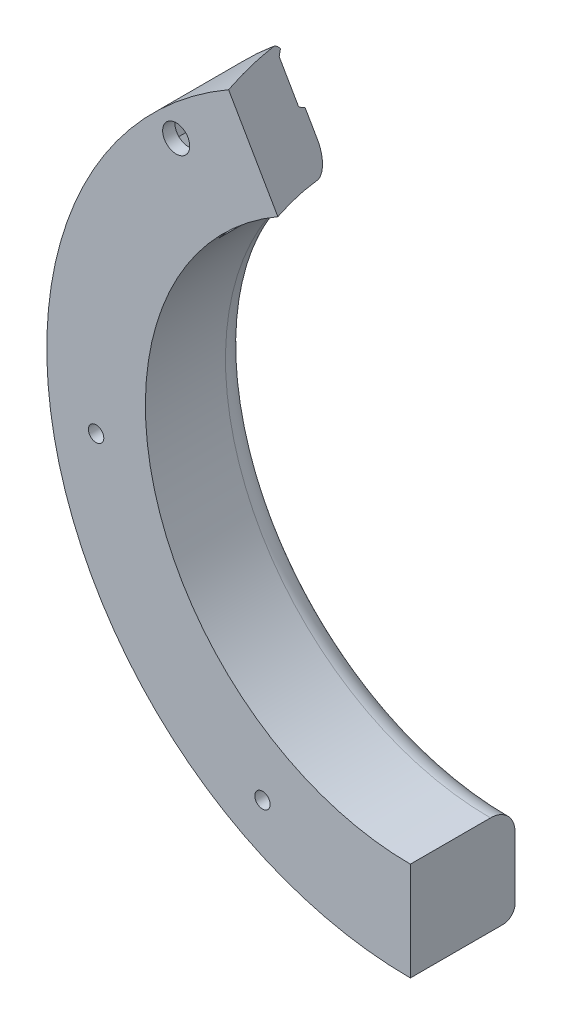
ISO-10303-21;
HEADER;
FILE_DESCRIPTION(('STEP AP214'),'2;1');
FILE_NAME('part.step','',(''),(''),'','','');
FILE_SCHEMA(('AUTOMOTIVE_DESIGN { 1 0 10303 214 1 1 1 1 }'));
ENDSEC;
DATA;
#1=APPLICATION_CONTEXT('core data for automotive mechanical design processes');
#2=APPLICATION_PROTOCOL_DEFINITION('international standard','automotive_design',2000,#1);
#3=PRODUCT_CONTEXT('',#1,'mechanical');
#4=PRODUCT('Part','Part','',(#3));
#5=PRODUCT_RELATED_PRODUCT_CATEGORY('part','',(#4));
#6=PRODUCT_DEFINITION_FORMATION('','',#4);
#7=PRODUCT_DEFINITION_CONTEXT('part definition',#1,'design');
#8=PRODUCT_DEFINITION('design','',#6,#7);
#9=PRODUCT_DEFINITION_SHAPE('','',#8);
#10=(LENGTH_UNIT() NAMED_UNIT(*) SI_UNIT(.MILLI.,.METRE.));
#11=(NAMED_UNIT(*) PLANE_ANGLE_UNIT() SI_UNIT($,.RADIAN.));
#12=(NAMED_UNIT(*) SI_UNIT($,.STERADIAN.) SOLID_ANGLE_UNIT());
#13=UNCERTAINTY_MEASURE_WITH_UNIT(LENGTH_MEASURE(1.E-05),#10,'distance_accuracy_value','');
#14=(GEOMETRIC_REPRESENTATION_CONTEXT(3) GLOBAL_UNCERTAINTY_ASSIGNED_CONTEXT((#13)) GLOBAL_UNIT_ASSIGNED_CONTEXT((#10,
#11,#12)) REPRESENTATION_CONTEXT('',''));
#15=CARTESIAN_POINT('',(0.,0.,0.));
#16=DIRECTION('',(0.,0.,1.));
#17=DIRECTION('',(1.,0.,0.));
#18=AXIS2_PLACEMENT_3D('',#15,#16,#17);
#19=CARTESIAN_POINT('',(-51.,-8.,-17.2023186219581));
#20=DIRECTION('',(0.,0.,1.));
#21=DIRECTION('',(-1.,0.,0.));
#22=AXIS2_PLACEMENT_3D('',#19,#20,#21);
#23=CYLINDRICAL_SURFACE('',#22,1.25000000000001);
#24=CARTESIAN_POINT('',(-51.,-8.,0.));
#25=DIRECTION('',(0.,0.,-1.));
#26=DIRECTION('',(-1.,0.,0.));
#27=AXIS2_PLACEMENT_3D('',#24,#25,#26);
#28=CIRCLE('',#27,1.25000000000001);
#29=CARTESIAN_POINT('',(-52.25,-8.,0.));
#30=VERTEX_POINT('',#29);
#31=EDGE_CURVE('E380',#30,#30,#28,.T.);
#32=ORIENTED_EDGE('',*,*,#31,.F.);
#33=EDGE_LOOP('',(#32));
#34=FACE_BOUND('',#33,.T.);
#35=CARTESIAN_POINT('',(-51.,-8.,-3.));
#36=DIRECTION('',(0.,0.,1.));
#37=DIRECTION('',(1.,0.,0.));
#38=AXIS2_PLACEMENT_3D('',#35,#36,#37);
#39=CIRCLE('',#38,1.25000000000001);
#40=CARTESIAN_POINT('',(-49.75,-8.,-3.));
#41=VERTEX_POINT('',#40);
#42=EDGE_CURVE('E372',#41,#41,#39,.F.);
#43=ORIENTED_EDGE('',*,*,#42,.T.);
#44=EDGE_LOOP('',(#43));
#45=FACE_BOUND('',#44,.T.);
#46=ADVANCED_FACE('F41',(#34,#45),#23,.F.);
#47=CARTESIAN_POINT('',(-24.,-46.,-17.2023186219581));
#48=DIRECTION('',(0.,0.,1.));
#49=DIRECTION('',(-1.,0.,0.));
#50=AXIS2_PLACEMENT_3D('',#47,#48,#49);
#51=CYLINDRICAL_SURFACE('',#50,1.25);
#52=CARTESIAN_POINT('',(-24.,-46.,0.));
#53=DIRECTION('',(0.,0.,-1.));
#54=DIRECTION('',(-1.,0.,0.));
#55=AXIS2_PLACEMENT_3D('',#52,#53,#54);
#56=CIRCLE('',#55,1.25);
#57=CARTESIAN_POINT('',(-25.25,-46.,0.));
#58=VERTEX_POINT('',#57);
#59=EDGE_CURVE('E195',#58,#58,#56,.T.);
#60=ORIENTED_EDGE('',*,*,#59,.F.);
#61=EDGE_LOOP('',(#60));
#62=FACE_BOUND('',#61,.T.);
#63=CARTESIAN_POINT('',(-24.,-46.,-3.));
#64=DIRECTION('',(0.,0.,1.));
#65=DIRECTION('',(1.,0.,0.));
#66=AXIS2_PLACEMENT_3D('',#63,#64,#65);
#67=CIRCLE('',#66,1.25);
#68=CARTESIAN_POINT('',(-22.75,-46.,-3.));
#69=VERTEX_POINT('',#68);
#70=EDGE_CURVE('E375',#69,#69,#67,.F.);
#71=ORIENTED_EDGE('',*,*,#70,.T.);
#72=EDGE_LOOP('',(#71));
#73=FACE_BOUND('',#72,.T.);
#74=ADVANCED_FACE('F287',(#62,#73),#51,.F.);
#75=CARTESIAN_POINT('',(-38.,40.,0.));
#76=DIRECTION('',(0.,0.,-1.));
#77=DIRECTION('',(1.,0.,0.));
#78=AXIS2_PLACEMENT_3D('',#75,#76,#77);
#79=CYLINDRICAL_SURFACE('',#78,2.2);
#80=CARTESIAN_POINT('',(-38.,40.,0.));
#81=DIRECTION('',(0.,0.,1.));
#82=DIRECTION('',(1.,0.,0.));
#83=AXIS2_PLACEMENT_3D('',#80,#81,#82);
#84=CIRCLE('',#83,2.2);
#85=CARTESIAN_POINT('',(-35.8,40.,0.));
#86=VERTEX_POINT('',#85);
#87=EDGE_CURVE('E228',#86,#86,#84,.T.);
#88=ORIENTED_EDGE('',*,*,#87,.T.);
#89=EDGE_LOOP('',(#88));
#90=FACE_BOUND('',#89,.T.);
#91=CARTESIAN_POINT('',(-38.,40.,-2.));
#92=DIRECTION('',(0.,0.,1.));
#93=DIRECTION('',(1.,0.,0.));
#94=AXIS2_PLACEMENT_3D('',#91,#92,#93);
#95=CIRCLE('',#94,2.2);
#96=CARTESIAN_POINT('',(-35.8,40.,-2.));
#97=VERTEX_POINT('',#96);
#98=EDGE_CURVE('E205',#97,#97,#95,.F.);
#99=ORIENTED_EDGE('',*,*,#98,.T.);
#100=EDGE_LOOP('',(#99));
#101=FACE_BOUND('',#100,.T.);
#102=ADVANCED_FACE('F294',(#90,#101),#79,.F.);
#103=CARTESIAN_POINT('',(-38.,40.,-6.));
#104=DIRECTION('',(0.,0.,1.));
#105=DIRECTION('',(1.,0.,0.));
#106=AXIS2_PLACEMENT_3D('',#103,#104,#105);
#107=CIRCLE('',#106,2.2);
#108=CARTESIAN_POINT('',(-35.8,40.,-6.));
#109=VERTEX_POINT('',#108);
#110=EDGE_CURVE('E208',#109,#109,#107,.F.);
#111=ORIENTED_EDGE('',*,*,#110,.F.);
#112=EDGE_LOOP('',(#111));
#113=FACE_BOUND('',#112,.T.);
#114=CARTESIAN_POINT('',(-38.,40.,-15.5));
#115=DIRECTION('',(0.,0.,1.));
#116=DIRECTION('',(1.,0.,0.));
#117=AXIS2_PLACEMENT_3D('',#114,#115,#116);
#118=CIRCLE('',#117,2.2);
#119=CARTESIAN_POINT('',(-35.8,40.,-15.5));
#120=VERTEX_POINT('',#119);
#121=EDGE_CURVE('E214',#120,#120,#118,.F.);
#122=ORIENTED_EDGE('',*,*,#121,.T.);
#123=EDGE_LOOP('',(#122));
#124=FACE_BOUND('',#123,.T.);
#125=ADVANCED_FACE('F324',(#113,#124),#79,.F.);
#126=CARTESIAN_POINT('',(0.,0.,-17.));
#127=DIRECTION('',(0.,0.,1.));
#128=DIRECTION('',(-1.,0.,0.));
#129=AXIS2_PLACEMENT_3D('',#126,#127,#128);
#130=CYLINDRICAL_SURFACE('',#129,43.);
#131=DIRECTION('',(0.,0.,1.));
#132=VECTOR('',#131,1.);
#133=CARTESIAN_POINT('',(-33.2355244808769,27.2836931605865,-17.));
#134=LINE('',#133,#132);
#135=CARTESIAN_POINT('',(-33.2355244808769,27.2836931605865,-2.));
#136=VERTEX_POINT('',#135);
#137=CARTESIAN_POINT('',(-33.2355244808769,27.2836931605865,-6.));
#138=VERTEX_POINT('',#137);
#139=EDGE_CURVE('E179',#136,#138,#134,.F.);
#140=ORIENTED_EDGE('',*,*,#139,.F.);
#141=CARTESIAN_POINT('',(0.,0.,-2.));
#142=DIRECTION('',(0.,0.,1.));
#143=DIRECTION('',(1.,0.,0.));
#144=AXIS2_PLACEMENT_3D('',#141,#142,#143);
#145=CIRCLE('',#144,43.);
#146=CARTESIAN_POINT('',(-26.3105496569665,34.011100787071,-2.));
#147=VERTEX_POINT('',#146);
#148=EDGE_CURVE('E362',#136,#147,#145,.F.);
#149=ORIENTED_EDGE('',*,*,#148,.T.);
#150=DIRECTION('',(0.,0.,1.));
#151=VECTOR('',#150,1.);
#152=CARTESIAN_POINT('',(-26.3105496569665,34.011100787071,-17.));
#153=LINE('',#152,#151);
#154=CARTESIAN_POINT('',(-26.3105496569665,34.011100787071,-6.));
#155=VERTEX_POINT('',#154);
#156=EDGE_CURVE('E370',#155,#147,#153,.T.);
#157=ORIENTED_EDGE('',*,*,#156,.F.);
#158=CARTESIAN_POINT('',(0.,0.,-6.));
#159=DIRECTION('',(0.,0.,1.));
#160=DIRECTION('',(1.,0.,0.));
#161=AXIS2_PLACEMENT_3D('',#158,#159,#160);
#162=CIRCLE('',#161,43.);
#163=EDGE_CURVE('E367',#138,#155,#162,.F.);
#164=ORIENTED_EDGE('',*,*,#163,.F.);
#165=EDGE_LOOP('',(#140,#149,#157,#164));
#166=FACE_BOUND('',#165,.T.);
#167=CARTESIAN_POINT('',(0.,0.,0.));
#168=DIRECTION('',(-0.734431194902493,-0.424024048078214,0.529919264233205));
#169=DIRECTION('',(0.458923544780714,0.264959632116603,0.848048096156426));
#170=AXIS2_PLACEMENT_3D('',#167,#168,#169);
#171=ELLIPSE('',#170,81.1444363363938,43.);
#172=CARTESIAN_POINT('',(-21.5000000000001,37.2390923627308,0.));
#173=VERTEX_POINT('',#172);
#174=CARTESIAN_POINT('',(-28.147848735378,32.5069009837954,-13.));
#175=VERTEX_POINT('',#174);
#176=EDGE_CURVE('E226',#173,#175,#171,.T.);
#177=ORIENTED_EDGE('',*,*,#176,.F.);
#178=CARTESIAN_POINT('',(0.,0.,0.));
#179=DIRECTION('',(0.,0.,-1.));
#180=DIRECTION('',(1.,0.,0.));
#181=AXIS2_PLACEMENT_3D('',#178,#179,#180);
#182=CIRCLE('',#181,43.);
#183=CARTESIAN_POINT('',(0.,-43.,0.));
#184=VERTEX_POINT('',#183);
#185=EDGE_CURVE('E230',#184,#173,#182,.T.);
#186=ORIENTED_EDGE('',*,*,#185,.F.);
#187=DIRECTION('',(0.,0.,1.));
#188=VECTOR('',#187,1.);
#189=CARTESIAN_POINT('',(0.,-43.,-17.));
#190=LINE('',#189,#188);
#191=CARTESIAN_POINT('',(0.,-43.,-13.));
#192=VERTEX_POINT('',#191);
#193=EDGE_CURVE('E233',#192,#184,#190,.T.);
#194=ORIENTED_EDGE('',*,*,#193,.F.);
#195=CARTESIAN_POINT('',(0.,0.,-13.));
#196=DIRECTION('',(0.,0.,1.));
#197=DIRECTION('',(1.,0.,0.));
#198=AXIS2_PLACEMENT_3D('',#195,#196,#197);
#199=CIRCLE('',#198,43.);
#200=EDGE_CURVE('E266',#175,#192,#199,.T.);
#201=ORIENTED_EDGE('',*,*,#200,.F.);
#202=EDGE_LOOP('',(#177,#186,#194,#201));
#203=FACE_BOUND('',#202,.T.);
#204=ADVANCED_FACE('F358',(#166,#203),#130,.F.);
#205=CARTESIAN_POINT('',(0.,0.,-17.));
#206=DIRECTION('',(0.,0.,1.));
#207=DIRECTION('',(-1.,0.,0.));
#208=AXIS2_PLACEMENT_3D('',#205,#206,#207);
#209=CYLINDRICAL_SURFACE('',#208,59.);
#210=DIRECTION('',(0.,0.,1.));
#211=VECTOR('',#210,1.);
#212=CARTESIAN_POINT('',(0.,-59.,-17.));
#213=LINE('',#212,#211);
#214=CARTESIAN_POINT('',(0.,-59.,-15.));
#215=VERTEX_POINT('',#214);
#216=CARTESIAN_POINT('',(0.,-59.,0.));
#217=VERTEX_POINT('',#216);
#218=EDGE_CURVE('E223',#215,#217,#213,.T.);
#219=ORIENTED_EDGE('',*,*,#218,.T.);
#220=CARTESIAN_POINT('',(0.,0.,0.));
#221=DIRECTION('',(0.,0.,1.));
#222=DIRECTION('',(1.,0.,0.));
#223=AXIS2_PLACEMENT_3D('',#220,#221,#222);
#224=CIRCLE('',#223,59.);
#225=CARTESIAN_POINT('',(-29.5000000000001,51.0954988232818,0.));
#226=VERTEX_POINT('',#225);
#227=EDGE_CURVE('E236',#226,#217,#224,.T.);
#228=ORIENTED_EDGE('',*,*,#227,.F.);
#229=CARTESIAN_POINT('',(0.,0.,0.));
#230=DIRECTION('',(-0.734431194902493,-0.424024048078214,0.529919264233205));
#231=DIRECTION('',(0.458923544780714,0.264959632116603,0.848048096156426));
#232=AXIS2_PLACEMENT_3D('',#229,#230,#231);
#233=ELLIPSE('',#232,111.337714973192,59.);
#234=CARTESIAN_POINT('',(-37.2426498564599,45.7600812026063,-15.));
#235=VERTEX_POINT('',#234);
#236=EDGE_CURVE('E247',#235,#226,#233,.F.);
#237=ORIENTED_EDGE('',*,*,#236,.F.);
#238=CARTESIAN_POINT('',(0.,0.,-15.));
#239=DIRECTION('',(0.,0.,1.));
#240=DIRECTION('',(1.,0.,0.));
#241=AXIS2_PLACEMENT_3D('',#238,#239,#240);
#242=CIRCLE('',#241,59.);
#243=EDGE_CURVE('E54',#215,#235,#242,.F.);
#244=ORIENTED_EDGE('',*,*,#243,.F.);
#245=EDGE_LOOP('',(#219,#228,#237,#244));
#246=FACE_BOUND('',#245,.T.);
#247=ADVANCED_FACE('F353',(#246),#209,.T.);
#248=CARTESIAN_POINT('',(0.,-43.,-17.));
#249=DIRECTION('',(-1.,0.,0.));
#250=DIRECTION('',(0.,-1.,0.));
#251=AXIS2_PLACEMENT_3D('',#248,#249,#250);
#252=PLANE('',#251);
#253=DIRECTION('',(0.,1.,0.));
#254=VECTOR('',#253,1.);
#255=CARTESIAN_POINT('',(0.,-43.,-17.));
#256=LINE('',#255,#254);
#257=CARTESIAN_POINT('',(0.,-57.,-17.));
#258=VERTEX_POINT('',#257);
#259=CARTESIAN_POINT('',(0.,-47.,-17.));
#260=VERTEX_POINT('',#259);
#261=EDGE_CURVE('E231',#258,#260,#256,.T.);
#262=ORIENTED_EDGE('',*,*,#261,.T.);
#263=CARTESIAN_POINT('',(0.,-47.,-13.));
#264=DIRECTION('',(1.,0.,0.));
#265=DIRECTION('',(0.,-1.,0.));
#266=AXIS2_PLACEMENT_3D('',#263,#264,#265);
#267=CIRCLE('',#266,4.);
#268=EDGE_CURVE('E363',#192,#260,#267,.F.);
#269=ORIENTED_EDGE('',*,*,#268,.F.);
#270=ORIENTED_EDGE('',*,*,#193,.T.);
#271=DIRECTION('',(0.,1.,0.));
#272=VECTOR('',#271,1.);
#273=CARTESIAN_POINT('',(0.,-43.,0.));
#274=LINE('',#273,#272);
#275=EDGE_CURVE('E234',#217,#184,#274,.T.);
#276=ORIENTED_EDGE('',*,*,#275,.F.);
#277=ORIENTED_EDGE('',*,*,#218,.F.);
#278=CARTESIAN_POINT('',(0.,-57.,-15.));
#279=DIRECTION('',(1.,0.,0.));
#280=DIRECTION('',(0.,-1.,0.));
#281=AXIS2_PLACEMENT_3D('',#278,#279,#280);
#282=CIRCLE('',#281,2.);
#283=EDGE_CURVE('E70',#258,#215,#282,.F.);
#284=ORIENTED_EDGE('',*,*,#283,.F.);
#285=EDGE_LOOP('',(#262,#269,#270,#276,#277,#284));
#286=FACE_BOUND('',#285,.T.);
#287=ADVANCED_FACE('F422',(#286),#252,.F.);
#288=CARTESIAN_POINT('',(0.,0.,-17.));
#289=DIRECTION('',(0.,0.,-1.));
#290=DIRECTION('',(1.,0.,0.));
#291=AXIS2_PLACEMENT_3D('',#288,#289,#290);
#292=PLANE('',#291);
#293=CARTESIAN_POINT('',(-51.,-8.,-17.));
#294=DIRECTION('',(0.,0.,1.));
#295=DIRECTION('',(1.,0.,0.));
#296=AXIS2_PLACEMENT_3D('',#293,#294,#295);
#297=CIRCLE('',#296,2.15);
#298=CARTESIAN_POINT('',(-48.85,-8.,-17.));
#299=VERTEX_POINT('',#298);
#300=EDGE_CURVE('E388',#299,#299,#297,.T.);
#301=ORIENTED_EDGE('',*,*,#300,.T.);
#302=EDGE_LOOP('',(#301));
#303=FACE_BOUND('',#302,.T.);
#304=CARTESIAN_POINT('',(-24.,-46.,-17.));
#305=DIRECTION('',(0.,0.,1.));
#306=DIRECTION('',(1.,0.,0.));
#307=AXIS2_PLACEMENT_3D('',#304,#305,#306);
#308=CIRCLE('',#307,2.15);
#309=CARTESIAN_POINT('',(-21.85,-46.,-17.));
#310=VERTEX_POINT('',#309);
#311=EDGE_CURVE('E390',#310,#310,#308,.T.);
#312=ORIENTED_EDGE('',*,*,#311,.T.);
#313=EDGE_LOOP('',(#312));
#314=FACE_BOUND('',#313,.T.);
#315=CARTESIAN_POINT('',(-38.,40.,-17.));
#316=DIRECTION('',(0.,0.,1.));
#317=DIRECTION('',(1.,0.,0.));
#318=AXIS2_PLACEMENT_3D('',#315,#316,#317);
#319=CIRCLE('',#318,4.5);
#320=CARTESIAN_POINT('',(-42.1814411983743,38.3370058615444,-17.));
#321=VERTEX_POINT('',#320);
#322=CARTESIAN_POINT('',(-34.0821060863576,37.7863814056066,-17.));
#323=VERTEX_POINT('',#322);
#324=EDGE_CURVE('E211',#321,#323,#319,.T.);
#325=ORIENTED_EDGE('',*,*,#324,.T.);
#326=DIRECTION('',(-0.500000000000001,0.866025403784438,0.));
#327=VECTOR('',#326,1.);
#328=CARTESIAN_POINT('',(-9.19959645759653,-5.3113894912293,-17.));
#329=LINE('',#328,#327);
#330=CARTESIAN_POINT('',(-32.0914976821008,34.3385465114602,-17.));
#331=VERTEX_POINT('',#330);
#332=EDGE_CURVE('E222',#323,#331,#329,.F.);
#333=ORIENTED_EDGE('',*,*,#332,.T.);
#334=CARTESIAN_POINT('',(0.,0.,-17.));
#335=DIRECTION('',(0.,0.,1.));
#336=DIRECTION('',(1.,0.,0.));
#337=AXIS2_PLACEMENT_3D('',#334,#335,#336);
#338=CIRCLE('',#337,47.);
#339=EDGE_CURVE('E260',#260,#331,#338,.F.);
#340=ORIENTED_EDGE('',*,*,#339,.F.);
#341=ORIENTED_EDGE('',*,*,#261,.F.);
#342=CARTESIAN_POINT('',(0.,0.,-17.));
#343=DIRECTION('',(0.,0.,1.));
#344=DIRECTION('',(1.,0.,0.));
#345=AXIS2_PLACEMENT_3D('',#342,#343,#344);
#346=CIRCLE('',#345,57.);
#347=EDGE_CURVE('E342',#321,#258,#346,.T.);
#348=ORIENTED_EDGE('',*,*,#347,.F.);
#349=EDGE_LOOP('',(#325,#333,#340,#341,#348));
#350=FACE_BOUND('',#349,.T.);
#351=ADVANCED_FACE('F425',(#303,#314,#350),#292,.T.);
#352=CARTESIAN_POINT('',(0.,0.,0.));
#353=DIRECTION('',(0.,0.,-1.));
#354=DIRECTION('',(1.,0.,0.));
#355=AXIS2_PLACEMENT_3D('',#352,#353,#354);
#356=PLANE('',#355);
#357=ORIENTED_EDGE('',*,*,#59,.T.);
#358=EDGE_LOOP('',(#357));
#359=FACE_BOUND('',#358,.T.);
#360=ORIENTED_EDGE('',*,*,#31,.T.);
#361=EDGE_LOOP('',(#360));
#362=FACE_BOUND('',#361,.T.);
#363=ORIENTED_EDGE('',*,*,#87,.F.);
#364=EDGE_LOOP('',(#363));
#365=FACE_BOUND('',#364,.T.);
#366=ORIENTED_EDGE('',*,*,#227,.T.);
#367=ORIENTED_EDGE('',*,*,#275,.T.);
#368=ORIENTED_EDGE('',*,*,#185,.T.);
#369=DIRECTION('',(0.500000000000001,-0.866025403784438,0.));
#370=VECTOR('',#369,1.);
#371=CARTESIAN_POINT('',(0.,0.,0.));
#372=LINE('',#371,#370);
#373=EDGE_CURVE('E225',#226,#173,#372,.T.);
#374=ORIENTED_EDGE('',*,*,#373,.F.);
#375=EDGE_LOOP('',(#366,#367,#368,#374));
#376=FACE_BOUND('',#375,.T.);
#377=ADVANCED_FACE('F351',(#359,#362,#365,#376),#356,.F.);
#378=CARTESIAN_POINT('',(0.,0.,0.));
#379=DIRECTION('',(0.734431194902493,0.424024048078214,-0.529919264233205));
#380=DIRECTION('',(-0.458923544780714,-0.264959632116603,-0.848048096156426));
#381=AXIS2_PLACEMENT_3D('',#378,#379,#380);
#382=PLANE('',#381);
#383=ORIENTED_EDGE('',*,*,#236,.T.);
#384=ORIENTED_EDGE('',*,*,#373,.T.);
#385=ORIENTED_EDGE('',*,*,#176,.T.);
#386=CARTESIAN_POINT('',(-32.0914976821008,34.3385465114602,-17.));
#387=CARTESIAN_POINT('',(-32.0441173314115,34.2564653410961,-17.0000127992273));
#388=CARTESIAN_POINT('',(-31.9949860389986,34.1753774028337,-16.9968041633533));
#389=CARTESIAN_POINT('',(-31.8934831136155,34.0157627677575,-16.9838465836971));
#390=CARTESIAN_POINT('',(-31.8411105360081,33.93723682789,-16.9740957250299));
#391=CARTESIAN_POINT('',(-31.7334464469897,33.7834151604823,-16.947963858566));
#392=CARTESIAN_POINT('',(-31.6781566771879,33.7081175531807,-16.9315867686422));
#393=CARTESIAN_POINT('',(-31.5649863733266,33.5613068483403,-16.8922137291379));
#394=CARTESIAN_POINT('',(-31.507106164156,33.4897932786548,-16.8692186076274));
#395=CARTESIAN_POINT('',(-31.3890251447208,33.3509649601313,-16.8166524141126));
#396=CARTESIAN_POINT('',(-31.3288198814839,33.2836589880112,-16.7870681477566));
#397=CARTESIAN_POINT('',(-31.2066186680223,33.1538976232157,-16.7215365727031));
#398=CARTESIAN_POINT('',(-31.1446220637796,33.0914440336437,-16.685586914798));
#399=CARTESIAN_POINT('',(-31.0193896726579,32.9719237409141,-16.607659767988));
#400=CARTESIAN_POINT('',(-30.956155308888,32.9148512450589,-16.5656888865403));
#401=CARTESIAN_POINT('',(-30.8288516621945,32.8063604438328,-16.4760656857115));
#402=CARTESIAN_POINT('',(-30.7647820741045,32.7549442737845,-16.4284112347758));
#403=CARTESIAN_POINT('',(-30.5741393287454,32.6112107579899,-16.2792045208507));
#404=CARTESIAN_POINT('',(-30.4469686946875,32.5273565106221,-16.1700523023634));
#405=CARTESIAN_POINT('',(-30.1945159297716,32.3835950524079,-15.9352035645956));
#406=CARTESIAN_POINT('',(-30.0692349981731,32.3237024798956,-15.8094969942896));
#407=CARTESIAN_POINT('',(-29.8132354797143,32.2236089823506,-15.534791030483));
#408=CARTESIAN_POINT('',(-29.6828893225016,32.1853779845714,-15.3847315272351));
#409=CARTESIAN_POINT('',(-29.4297718975868,32.1349271913105,-15.0742974774717));
#410=CARTESIAN_POINT('',(-29.3070041966,32.1227195541554,-14.9139181454802));
#411=CARTESIAN_POINT('',(-29.0508625327763,32.1222830057516,-14.5592729497127));
#412=CARTESIAN_POINT('',(-28.9191390904876,32.1383970598648,-14.3638194937553));
#413=CARTESIAN_POINT('',(-28.6696743191747,32.2000606268362,-13.9687375265606));
#414=CARTESIAN_POINT('',(-28.5519360069393,32.2456164771019,-13.7691081253966));
#415=CARTESIAN_POINT('',(-28.3893006832174,32.3323207902104,-13.474328940136));
#416=CARTESIAN_POINT('',(-28.3385631147339,32.3632700353728,-13.3792456309089));
#417=CARTESIAN_POINT('',(-28.2405802716269,32.4308723756855,-13.1893550544877));
#418=CARTESIAN_POINT('',(-28.1933336946351,32.4675233277171,-13.0945476971552));
#419=CARTESIAN_POINT('',(-28.147848735378,32.5069009837954,-13.));
#420=B_SPLINE_CURVE_WITH_KNOTS('',3,(#386,#387,#388,#389,#390,#391,#392,#393,#394,#395,#396,
#397,#398,#399,#400,#401,#402,#403,#404,#405,#406,#407,#408,#409,#410,#411,#412,#413,#414,#415,
#416,#417,#418,#419),.UNSPECIFIED.,.F.,.F.,(4,2,2,2,2,2,2,2,2,2,2,2,2,2,2,2,4),(0.,
0.284270435740037,0.568624112725402,0.852809905844514,1.13696015614454,1.42168459862633,
1.70651434119904,1.99103388012647,2.27566046224159,2.83520868576079,3.39509822065792,
3.99999454163373,4.60517341322725,5.31137529450041,6.01772923784115,6.35395134248585,
6.69004737425372),.UNSPECIFIED.);
#421=EDGE_CURVE('E257',#331,#175,#420,.T.);
#422=ORIENTED_EDGE('',*,*,#421,.F.);
#423=ORIENTED_EDGE('',*,*,#332,.F.);
#424=CARTESIAN_POINT('',(-38.,40.,-20.6586629738911));
#425=DIRECTION('',(-0.734431194902493,-0.424024048078214,0.529919264233205));
#426=DIRECTION('',(-0.458923544780714,-0.264959632116603,-0.848048096156426));
#427=AXIS2_PLACEMENT_3D('',#424,#425,#426);
#428=ELLIPSE('',#427,8.49185961659935,4.5);
#429=CARTESIAN_POINT('',(-33.6384144703477,38.8924930395129,-15.5));
#430=VERTEX_POINT('',#429);
#431=EDGE_CURVE('E255',#430,#323,#428,.F.);
#432=ORIENTED_EDGE('',*,*,#431,.F.);
#433=DIRECTION('',(0.500000000000001,-0.866025403784438,0.));
#434=VECTOR('',#433,1.);
#435=CARTESIAN_POINT('',(-8.38786735839684,-4.84273747729731,-15.5));
#436=LINE('',#435,#434);
#437=CARTESIAN_POINT('',(-36.7783363978237,44.3309973497011,-15.5));
#438=VERTEX_POINT('',#437);
#439=EDGE_CURVE('E221',#430,#438,#436,.F.);
#440=ORIENTED_EDGE('',*,*,#439,.T.);
#441=CARTESIAN_POINT('',(-37.625313884209,44.4843740159172,-16.5511248223778));
#442=VERTEX_POINT('',#441);
#443=EDGE_CURVE('E258',#442,#438,#428,.F.);
#444=ORIENTED_EDGE('',*,*,#443,.F.);
#445=CARTESIAN_POINT('',(-37.2426498564599,45.7600812026063,-15.));
#446=CARTESIAN_POINT('',(-37.3131660583271,45.70268137367,-15.143660008911));
#447=CARTESIAN_POINT('',(-37.3751720418364,45.6320080511825,-15.2861464628832));
#448=CARTESIAN_POINT('',(-37.4808591790824,45.4666639852444,-15.5649243836519));
#449=CARTESIAN_POINT('',(-37.5244437778289,45.3718708700007,-15.7011799498594));
#450=CARTESIAN_POINT('',(-37.5886857848751,45.1694769847509,-15.9521638591162));
#451=CARTESIAN_POINT('',(-37.6108323784491,45.0633945577961,-16.067741180838));
#452=CARTESIAN_POINT('',(-37.6362524301185,44.8362480599751,-16.2847267939225));
#453=CARTESIAN_POINT('',(-37.6396131588653,44.7152559384838,-16.3861984647955));
#454=CARTESIAN_POINT('',(-37.6311285214431,44.5541179898986,-16.5033766597563));
#455=CARTESIAN_POINT('',(-37.6285939944917,44.5194433713804,-16.5276094765625));
#456=CARTESIAN_POINT('',(-37.625313884209,44.4843740159172,-16.5511248223778));
#457=B_SPLINE_CURVE_WITH_KNOTS('',3,(#445,#446,#447,#448,#449,#450,#451,#452,#453,#454,#455,
#456),.UNSPECIFIED.,.F.,.F.,(4,2,2,2,2,4),(0.,0.509320768213792,1.0212789748977,
1.49437659974831,1.96527458837673,2.0923565871867),.UNSPECIFIED.);
#458=EDGE_CURVE('E11',#235,#442,#457,.T.);
#459=ORIENTED_EDGE('',*,*,#458,.F.);
#460=EDGE_LOOP('',(#383,#384,#385,#422,#423,#432,#440,#444,#459));
#461=FACE_BOUND('',#460,.T.);
#462=ADVANCED_FACE('F268',(#461),#382,.T.);
#463=CARTESIAN_POINT('',(-38.,40.,-15.5));
#464=DIRECTION('',(0.,0.,-1.));
#465=DIRECTION('',(1.,0.,0.));
#466=AXIS2_PLACEMENT_3D('',#463,#464,#465);
#467=CYLINDRICAL_SURFACE('',#466,4.5);
#468=ORIENTED_EDGE('',*,*,#443,.T.);
#469=CARTESIAN_POINT('',(-38.,40.,-15.5));
#470=DIRECTION('',(0.,0.,1.));
#471=DIRECTION('',(1.,0.,0.));
#472=AXIS2_PLACEMENT_3D('',#469,#470,#471);
#473=CIRCLE('',#472,4.5);
#474=CARTESIAN_POINT('',(-38.706982851157,44.4441169255736,-15.5));
#475=VERTEX_POINT('',#474);
#476=EDGE_CURVE('E215',#438,#475,#473,.T.);
#477=ORIENTED_EDGE('',*,*,#476,.T.);
#478=CARTESIAN_POINT('',(-37.625313884209,44.4843740159172,-16.5511248223778));
#479=CARTESIAN_POINT('',(-37.6983783613772,44.4904952169297,-16.5088745260641));
#480=CARTESIAN_POINT('',(-37.7702051350384,44.4946823459739,-16.4641731363524));
#481=CARTESIAN_POINT('',(-37.910848099808,44.4996643659715,-16.3696612265684));
#482=CARTESIAN_POINT('',(-37.9796546444238,44.5004490740053,-16.3198358260135));
#483=CARTESIAN_POINT('',(-38.1134580633845,44.4990692521196,-16.2149781406572));
#484=CARTESIAN_POINT('',(-38.1784440433759,44.4968966782383,-16.1599320346391));
#485=CARTESIAN_POINT('',(-38.3032125728569,44.4902055775834,-16.0444744867865));
#486=CARTESIAN_POINT('',(-38.3630036142652,44.4856909667903,-15.9840721401411));
#487=CARTESIAN_POINT('',(-38.4385440832511,44.4786218110678,-15.8991658901473));
#488=CARTESIAN_POINT('',(-38.4573221009123,44.4767394874074,-15.8772726075873));
#489=CARTESIAN_POINT('',(-38.4939723187367,44.4728436841077,-15.8327978574423));
#490=CARTESIAN_POINT('',(-38.5118455957563,44.4708303672343,-15.8102172617774));
#491=CARTESIAN_POINT('',(-38.5632148626085,44.4647455809901,-15.7424025846236));
#492=CARTESIAN_POINT('',(-38.5953412478078,44.4605436535869,-15.6961156869489));
#493=CARTESIAN_POINT('',(-38.654959419001,44.4521859186556,-15.6004048821661));
#494=CARTESIAN_POINT('',(-38.6824323163923,44.4480303601717,-15.550969260338));
#495=CARTESIAN_POINT('',(-38.706982851157,44.4441169255736,-15.5));
#496=B_SPLINE_CURVE_WITH_KNOTS('',3,(#478,#479,#480,#481,#482,#483,#484,#485,#486,#487,#488,
#489,#490,#491,#492,#493,#494,#495),.UNSPECIFIED.,.F.,.F.,(4,2,2,2,2,2,2,2,4),(0.,
0.253826358950735,0.508411858842638,0.763691230179856,1.01854513328556,1.10524005959743,
1.19182924749542,1.36105692109188,1.53095583682827),.UNSPECIFIED.);
#497=EDGE_CURVE('E328',#442,#475,#496,.T.);
#498=ORIENTED_EDGE('',*,*,#497,.F.);
#499=EDGE_LOOP('',(#468,#477,#498));
#500=FACE_BOUND('',#499,.T.);
#501=ADVANCED_FACE('F319',(#500),#467,.F.);
#502=CARTESIAN_POINT('',(-42.4020453774518,40.9338075255936,-15.5));
#503=VERTEX_POINT('',#502);
#504=EDGE_CURVE('E216',#503,#430,#473,.T.);
#505=ORIENTED_EDGE('',*,*,#504,.T.);
#506=ORIENTED_EDGE('',*,*,#431,.T.);
#507=ORIENTED_EDGE('',*,*,#324,.F.);
#508=CARTESIAN_POINT('',(-42.4020453774518,40.9338075255936,-15.5));
#509=CARTESIAN_POINT('',(-42.4077924255814,40.9067712668251,-15.5566286511159));
#510=CARTESIAN_POINT('',(-42.4140104676027,40.8761874330857,-15.6113407298066));
#511=CARTESIAN_POINT('',(-42.4267385673914,40.809385689371,-15.7169205023316));
#512=CARTESIAN_POINT('',(-42.4332474849238,40.7731886042738,-15.7678014127928));
#513=CARTESIAN_POINT('',(-42.4459093109943,40.6967006851029,-15.8657381449159));
#514=CARTESIAN_POINT('',(-42.4520645688716,40.6564434097022,-15.9128203315046));
#515=CARTESIAN_POINT('',(-42.4636486580726,40.5724006345643,-16.0039021422645));
#516=CARTESIAN_POINT('',(-42.4690766167376,40.5286109955893,-16.047898033692));
#517=CARTESIAN_POINT('',(-42.4806639221673,40.4213498321244,-16.1487875707084));
#518=CARTESIAN_POINT('',(-42.4863450099847,40.3566132843943,-16.204395694912));
#519=CARTESIAN_POINT('',(-42.494976484106,40.222924652242,-16.310424162877));
#520=CARTESIAN_POINT('',(-42.4979269673846,40.1539727176179,-16.3608446908144));
#521=CARTESIAN_POINT('',(-42.5018494502298,39.941057193623,-16.5051901559803));
#522=CARTESIAN_POINT('',(-42.4978111333515,39.7916880017194,-16.5916039541722));
#523=CARTESIAN_POINT('',(-42.4791249632662,39.5599986527026,-16.7053856557946));
#524=CARTESIAN_POINT('',(-42.4706984133583,39.4809785024694,-16.7408437062592));
#525=CARTESIAN_POINT('',(-42.449217485708,39.3210647598702,-16.8057873110302));
#526=CARTESIAN_POINT('',(-42.4361621057492,39.2401707653346,-16.8352715697402));
#527=CARTESIAN_POINT('',(-42.4052368588862,39.0776685675312,-16.8875085456511));
#528=CARTESIAN_POINT('',(-42.3873953866893,38.9960672384336,-16.9102993544706));
#529=CARTESIAN_POINT('',(-42.3467161312285,38.8324595262635,-16.9486629148819));
#530=CARTESIAN_POINT('',(-42.3238829080861,38.7504535792214,-16.9642422141828));
#531=CARTESIAN_POINT('',(-42.2813199114425,38.6130273100524,-16.9837177775432));
#532=CARTESIAN_POINT('',(-42.2629314545174,38.5574886711731,-16.9897567399911));
#533=CARTESIAN_POINT('',(-42.2238765624401,38.4468328191185,-16.9979012113355));
#534=CARTESIAN_POINT('',(-42.203206670251,38.3917163846706,-17.0000006616269));
#535=CARTESIAN_POINT('',(-42.1814411983743,38.3370058615444,-17.));
#536=B_SPLINE_CURVE_WITH_KNOTS('',3,(#508,#509,#510,#511,#512,#513,#514,#515,#516,#517,#518,
#519,#520,#521,#522,#523,#524,#525,#526,#527,#528,#529,#530,#531,#532,#533,#534,#535),
.UNSPECIFIED.,.F.,.F.,(4,2,2,2,2,2,2,2,2,2,2,2,2,4),(0.,0.188686444289959,0.376688917585035,
0.563248191370222,0.750029343463055,1.00624746862943,1.26245649410671,1.77750956462635,
2.03831349892136,2.29917393598931,2.55851972785229,2.81762958189404,2.99390766633958,
3.17045662867841),.UNSPECIFIED.);
#537=EDGE_CURVE('E339',#503,#321,#536,.T.);
#538=ORIENTED_EDGE('',*,*,#537,.F.);
#539=EDGE_LOOP('',(#505,#506,#507,#538));
#540=FACE_BOUND('',#539,.T.);
#541=ADVANCED_FACE('F282',(#540),#467,.F.);
#542=CARTESIAN_POINT('',(-38.,40.,-15.5));
#543=DIRECTION('',(0.,0.,-1.));
#544=DIRECTION('',(1.,0.,0.));
#545=AXIS2_PLACEMENT_3D('',#542,#543,#544);
#546=PLANE('',#545);
#547=ORIENTED_EDGE('',*,*,#121,.F.);
#548=EDGE_LOOP('',(#547));
#549=FACE_BOUND('',#548,.T.);
#550=ORIENTED_EDGE('',*,*,#476,.F.);
#551=ORIENTED_EDGE('',*,*,#439,.F.);
#552=ORIENTED_EDGE('',*,*,#504,.F.);
#553=CARTESIAN_POINT('',(0.,0.,-15.5));
#554=DIRECTION('',(0.,0.,1.));
#555=DIRECTION('',(1.,0.,0.));
#556=AXIS2_PLACEMENT_3D('',#553,#554,#555);
#557=CIRCLE('',#556,58.9364916731037);
#558=EDGE_CURVE('E343',#475,#503,#557,.T.);
#559=ORIENTED_EDGE('',*,*,#558,.F.);
#560=EDGE_LOOP('',(#550,#551,#552,#559));
#561=FACE_BOUND('',#560,.T.);
#562=ADVANCED_FACE('F274',(#549,#561),#546,.T.);
#563=CARTESIAN_POINT('',(0.,0.,-13.));
#564=DIRECTION('',(0.,0.,-1.));
#565=DIRECTION('',(1.,0.,0.));
#566=AXIS2_PLACEMENT_3D('',#563,#564,#565);
#567=TOROIDAL_SURFACE('',#566,47.,4.);
#568=ORIENTED_EDGE('',*,*,#268,.T.);
#569=ORIENTED_EDGE('',*,*,#339,.T.);
#570=ORIENTED_EDGE('',*,*,#421,.T.);
#571=ORIENTED_EDGE('',*,*,#200,.T.);
#572=EDGE_LOOP('',(#568,#569,#570,#571));
#573=FACE_BOUND('',#572,.T.);
#574=ADVANCED_FACE('F271',(#573),#567,.T.);
#575=CARTESIAN_POINT('',(-35.0856320104707,42.8826710799084,-6.));
#576=DIRECTION('',(0.710962454903831,0.703229967874747,0.));
#577=DIRECTION('',(-0.703229967874747,0.710962454903831,0.));
#578=AXIS2_PLACEMENT_3D('',#575,#576,#577);
#579=PLANE('',#578);
#580=DIRECTION('',(0.703229967874747,-0.710962454903831,0.));
#581=VECTOR('',#580,1.);
#582=CARTESIAN_POINT('',(-35.0856320104707,42.8826710799084,-6.));
#583=LINE('',#582,#581);
#584=CARTESIAN_POINT('',(-35.0856320104707,42.8826710799084,-6.));
#585=VERTEX_POINT('',#584);
#586=EDGE_CURVE('E182',#585,#155,#583,.T.);
#587=ORIENTED_EDGE('',*,*,#586,.T.);
#588=ORIENTED_EDGE('',*,*,#156,.T.);
#589=DIRECTION('',(0.703229967874747,-0.710962454903831,0.));
#590=VECTOR('',#589,1.);
#591=CARTESIAN_POINT('',(-35.0856320104707,42.8826710799084,-2.));
#592=LINE('',#591,#590);
#593=CARTESIAN_POINT('',(-35.0856320104707,42.8826710799084,-2.));
#594=VERTEX_POINT('',#593);
#595=EDGE_CURVE('E190',#594,#147,#592,.T.);
#596=ORIENTED_EDGE('',*,*,#595,.F.);
#597=DIRECTION('',(0.,0.,1.));
#598=VECTOR('',#597,1.);
#599=CARTESIAN_POINT('',(-35.0856320104707,42.8826710799084,-6.));
#600=LINE('',#599,#598);
#601=EDGE_CURVE('E200',#585,#594,#600,.T.);
#602=ORIENTED_EDGE('',*,*,#601,.F.);
#603=EDGE_LOOP('',(#587,#588,#596,#602));
#604=FACE_BOUND('',#603,.T.);
#605=ADVANCED_FACE('F273',(#604),#579,.F.);
#606=CARTESIAN_POINT('',(-40.9143679895293,37.1173289200916,-6.));
#607=DIRECTION('',(-0.788167618649444,-0.61546064448709,0.));
#608=DIRECTION('',(0.61546064448709,-0.788167618649444,0.));
#609=AXIS2_PLACEMENT_3D('',#606,#607,#608);
#610=PLANE('',#609);
#611=DIRECTION('',(-0.61546064448709,0.788167618649444,0.));
#612=VECTOR('',#611,1.);
#613=CARTESIAN_POINT('',(-40.9143679895293,37.1173289200916,-2.));
#614=LINE('',#613,#612);
#615=CARTESIAN_POINT('',(-40.9143679895293,37.1173289200916,-2.));
#616=VERTEX_POINT('',#615);
#617=EDGE_CURVE('E191',#136,#616,#614,.T.);
#618=ORIENTED_EDGE('',*,*,#617,.F.);
#619=ORIENTED_EDGE('',*,*,#139,.T.);
#620=DIRECTION('',(-0.61546064448709,0.788167618649444,0.));
#621=VECTOR('',#620,1.);
#622=CARTESIAN_POINT('',(-40.9143679895293,37.1173289200916,-6.));
#623=LINE('',#622,#621);
#624=CARTESIAN_POINT('',(-40.9143679895293,37.1173289200916,-6.));
#625=VERTEX_POINT('',#624);
#626=EDGE_CURVE('E159',#138,#625,#623,.T.);
#627=ORIENTED_EDGE('',*,*,#626,.T.);
#628=DIRECTION('',(0.,0.,1.));
#629=VECTOR('',#628,1.);
#630=CARTESIAN_POINT('',(-40.9143679895293,37.1173289200916,-6.));
#631=LINE('',#630,#629);
#632=EDGE_CURVE('E169',#625,#616,#631,.T.);
#633=ORIENTED_EDGE('',*,*,#632,.T.);
#634=EDGE_LOOP('',(#618,#619,#627,#633));
#635=FACE_BOUND('',#634,.T.);
#636=ADVANCED_FACE('F177',(#635),#610,.F.);
#637=CARTESIAN_POINT('',(0.,0.,-6.));
#638=DIRECTION('',(0.,0.,-1.));
#639=DIRECTION('',(1.,0.,0.));
#640=AXIS2_PLACEMENT_3D('',#637,#638,#639);
#641=PLANE('',#640);
#642=ORIENTED_EDGE('',*,*,#626,.F.);
#643=ORIENTED_EDGE('',*,*,#163,.T.);
#644=ORIENTED_EDGE('',*,*,#586,.F.);
#645=DIRECTION('',(0.964496244333962,-0.264096563146289,0.));
#646=VECTOR('',#645,1.);
#647=CARTESIAN_POINT('',(-39.0392823911907,43.9652522548628,-6.));
#648=LINE('',#647,#646);
#649=CARTESIAN_POINT('',(-39.0392823911907,43.9652522548628,-6.));
#650=VERTEX_POINT('',#649);
#651=EDGE_CURVE('E171',#650,#585,#648,.T.);
#652=ORIENTED_EDGE('',*,*,#651,.F.);
#653=DIRECTION('',(0.710962454903827,0.703229967874751,0.));
#654=VECTOR('',#653,1.);
#655=CARTESIAN_POINT('',(-41.95365038072,41.0825811749544,-6.));
#656=LINE('',#655,#654);
#657=CARTESIAN_POINT('',(-41.95365038072,41.0825811749544,-6.));
#658=VERTEX_POINT('',#657);
#659=EDGE_CURVE('E163',#658,#650,#656,.T.);
#660=ORIENTED_EDGE('',*,*,#659,.F.);
#661=DIRECTION('',(-0.253533789430134,0.967326531021039,0.));
#662=VECTOR('',#661,1.);
#663=CARTESIAN_POINT('',(-40.9143679895293,37.1173289200916,-6.));
#664=LINE('',#663,#662);
#665=EDGE_CURVE('E152',#625,#658,#664,.T.);
#666=ORIENTED_EDGE('',*,*,#665,.F.);
#667=EDGE_LOOP('',(#642,#643,#644,#652,#660,#666));
#668=FACE_BOUND('',#667,.T.);
#669=ORIENTED_EDGE('',*,*,#110,.T.);
#670=EDGE_LOOP('',(#669));
#671=FACE_BOUND('',#670,.T.);
#672=ADVANCED_FACE('F156',(#668,#671),#641,.F.);
#673=CARTESIAN_POINT('',(0.,0.,-2.));
#674=DIRECTION('',(0.,0.,-1.));
#675=DIRECTION('',(1.,0.,0.));
#676=AXIS2_PLACEMENT_3D('',#673,#674,#675);
#677=PLANE('',#676);
#678=ORIENTED_EDGE('',*,*,#148,.F.);
#679=ORIENTED_EDGE('',*,*,#617,.T.);
#680=DIRECTION('',(-0.253533789430134,0.967326531021039,0.));
#681=VECTOR('',#680,1.);
#682=CARTESIAN_POINT('',(-40.9143679895293,37.1173289200916,-2.));
#683=LINE('',#682,#681);
#684=CARTESIAN_POINT('',(-41.95365038072,41.0825811749544,-2.));
#685=VERTEX_POINT('',#684);
#686=EDGE_CURVE('E173',#616,#685,#683,.T.);
#687=ORIENTED_EDGE('',*,*,#686,.T.);
#688=DIRECTION('',(0.710962454903827,0.703229967874751,0.));
#689=VECTOR('',#688,1.);
#690=CARTESIAN_POINT('',(-41.95365038072,41.0825811749544,-2.));
#691=LINE('',#690,#689);
#692=CARTESIAN_POINT('',(-39.0392823911907,43.9652522548628,-2.));
#693=VERTEX_POINT('',#692);
#694=EDGE_CURVE('E194',#685,#693,#691,.T.);
#695=ORIENTED_EDGE('',*,*,#694,.T.);
#696=DIRECTION('',(0.964496244333962,-0.264096563146289,0.));
#697=VECTOR('',#696,1.);
#698=CARTESIAN_POINT('',(-39.0392823911907,43.9652522548628,-2.));
#699=LINE('',#698,#697);
#700=EDGE_CURVE('E181',#693,#594,#699,.T.);
#701=ORIENTED_EDGE('',*,*,#700,.T.);
#702=ORIENTED_EDGE('',*,*,#595,.T.);
#703=EDGE_LOOP('',(#678,#679,#687,#695,#701,#702));
#704=FACE_BOUND('',#703,.T.);
#705=ORIENTED_EDGE('',*,*,#98,.F.);
#706=EDGE_LOOP('',(#705));
#707=FACE_BOUND('',#706,.T.);
#708=ADVANCED_FACE('F302',(#704,#707),#677,.T.);
#709=CARTESIAN_POINT('',(-39.0392823911907,43.9652522548628,-6.));
#710=DIRECTION('',(0.264096563146289,0.964496244333962,0.));
#711=DIRECTION('',(-0.964496244333962,0.264096563146289,0.));
#712=AXIS2_PLACEMENT_3D('',#709,#710,#711);
#713=PLANE('',#712);
#714=ORIENTED_EDGE('',*,*,#700,.F.);
#715=DIRECTION('',(0.,0.,1.));
#716=VECTOR('',#715,1.);
#717=CARTESIAN_POINT('',(-39.0392823911907,43.9652522548628,-6.));
#718=LINE('',#717,#716);
#719=EDGE_CURVE('E201',#650,#693,#718,.T.);
#720=ORIENTED_EDGE('',*,*,#719,.F.);
#721=ORIENTED_EDGE('',*,*,#651,.T.);
#722=ORIENTED_EDGE('',*,*,#601,.T.);
#723=EDGE_LOOP('',(#714,#720,#721,#722));
#724=FACE_BOUND('',#723,.T.);
#725=ADVANCED_FACE('F308',(#724),#713,.F.);
#726=CARTESIAN_POINT('',(-41.95365038072,41.0825811749544,-6.));
#727=DIRECTION('',(-0.703229967874751,0.710962454903828,0.));
#728=DIRECTION('',(-0.710962454903828,-0.703229967874751,0.));
#729=AXIS2_PLACEMENT_3D('',#726,#727,#728);
#730=PLANE('',#729);
#731=ORIENTED_EDGE('',*,*,#694,.F.);
#732=DIRECTION('',(0.,0.,1.));
#733=VECTOR('',#732,1.);
#734=CARTESIAN_POINT('',(-41.95365038072,41.0825811749544,-6.));
#735=LINE('',#734,#733);
#736=EDGE_CURVE('E175',#658,#685,#735,.T.);
#737=ORIENTED_EDGE('',*,*,#736,.F.);
#738=ORIENTED_EDGE('',*,*,#659,.T.);
#739=ORIENTED_EDGE('',*,*,#719,.T.);
#740=EDGE_LOOP('',(#731,#737,#738,#739));
#741=FACE_BOUND('',#740,.T.);
#742=ADVANCED_FACE('F309',(#741),#730,.F.);
#743=CARTESIAN_POINT('',(-40.9143679895293,37.1173289200916,-6.));
#744=DIRECTION('',(-0.967326531021039,-0.253533789430134,0.));
#745=DIRECTION('',(0.253533789430134,-0.967326531021039,0.));
#746=AXIS2_PLACEMENT_3D('',#743,#744,#745);
#747=PLANE('',#746);
#748=ORIENTED_EDGE('',*,*,#686,.F.);
#749=ORIENTED_EDGE('',*,*,#632,.F.);
#750=ORIENTED_EDGE('',*,*,#665,.T.);
#751=ORIENTED_EDGE('',*,*,#736,.T.);
#752=EDGE_LOOP('',(#748,#749,#750,#751));
#753=FACE_BOUND('',#752,.T.);
#754=ADVANCED_FACE('F166',(#753),#747,.F.);
#755=CARTESIAN_POINT('',(-24.,-46.,-3.));
#756=DIRECTION('',(0.,0.,-1.));
#757=DIRECTION('',(1.,0.,0.));
#758=AXIS2_PLACEMENT_3D('',#755,#756,#757);
#759=PLANE('',#758);
#760=CARTESIAN_POINT('',(-24.,-46.,-3.));
#761=DIRECTION('',(0.,0.,1.));
#762=DIRECTION('',(1.,0.,0.));
#763=AXIS2_PLACEMENT_3D('',#760,#761,#762);
#764=CIRCLE('',#763,2.15);
#765=CARTESIAN_POINT('',(-21.85,-46.,-3.));
#766=VERTEX_POINT('',#765);
#767=EDGE_CURVE('E383',#766,#766,#764,.T.);
#768=ORIENTED_EDGE('',*,*,#767,.F.);
#769=EDGE_LOOP('',(#768));
#770=FACE_BOUND('',#769,.T.);
#771=ORIENTED_EDGE('',*,*,#70,.F.);
#772=EDGE_LOOP('',(#771));
#773=FACE_BOUND('',#772,.T.);
#774=ADVANCED_FACE('F320',(#770,#773),#759,.T.);
#775=CARTESIAN_POINT('',(-24.,-46.,-3.));
#776=DIRECTION('',(0.,0.,-1.));
#777=DIRECTION('',(1.,0.,0.));
#778=AXIS2_PLACEMENT_3D('',#775,#776,#777);
#779=CYLINDRICAL_SURFACE('',#778,2.15);
#780=ORIENTED_EDGE('',*,*,#767,.T.);
#781=EDGE_LOOP('',(#780));
#782=FACE_BOUND('',#781,.T.);
#783=ORIENTED_EDGE('',*,*,#311,.F.);
#784=EDGE_LOOP('',(#783));
#785=FACE_BOUND('',#784,.T.);
#786=ADVANCED_FACE('F405',(#782,#785),#779,.F.);
#787=CARTESIAN_POINT('',(-51.,-8.,-3.));
#788=DIRECTION('',(0.,0.,-1.));
#789=DIRECTION('',(1.,0.,0.));
#790=AXIS2_PLACEMENT_3D('',#787,#788,#789);
#791=PLANE('',#790);
#792=CARTESIAN_POINT('',(-51.,-8.,-3.));
#793=DIRECTION('',(0.,0.,1.));
#794=DIRECTION('',(1.,0.,0.));
#795=AXIS2_PLACEMENT_3D('',#792,#793,#794);
#796=CIRCLE('',#795,2.15);
#797=CARTESIAN_POINT('',(-48.85,-8.,-3.));
#798=VERTEX_POINT('',#797);
#799=EDGE_CURVE('E374',#798,#798,#796,.T.);
#800=ORIENTED_EDGE('',*,*,#799,.F.);
#801=EDGE_LOOP('',(#800));
#802=FACE_BOUND('',#801,.T.);
#803=ORIENTED_EDGE('',*,*,#42,.F.);
#804=EDGE_LOOP('',(#803));
#805=FACE_BOUND('',#804,.T.);
#806=ADVANCED_FACE('F398',(#802,#805),#791,.T.);
#807=CARTESIAN_POINT('',(-51.,-8.,-3.));
#808=DIRECTION('',(0.,0.,-1.));
#809=DIRECTION('',(1.,0.,0.));
#810=AXIS2_PLACEMENT_3D('',#807,#808,#809);
#811=CYLINDRICAL_SURFACE('',#810,2.15);
#812=ORIENTED_EDGE('',*,*,#799,.T.);
#813=EDGE_LOOP('',(#812));
#814=FACE_BOUND('',#813,.T.);
#815=ORIENTED_EDGE('',*,*,#300,.F.);
#816=EDGE_LOOP('',(#815));
#817=FACE_BOUND('',#816,.T.);
#818=ADVANCED_FACE('F396',(#814,#817),#811,.F.);
#819=CARTESIAN_POINT('',(0.,0.,-15.));
#820=DIRECTION('',(0.,0.,-1.));
#821=DIRECTION('',(1.,0.,0.));
#822=AXIS2_PLACEMENT_3D('',#819,#820,#821);
#823=TOROIDAL_SURFACE('',#822,57.,2.);
#824=ORIENTED_EDGE('',*,*,#458,.T.);
#825=ORIENTED_EDGE('',*,*,#497,.T.);
#826=ORIENTED_EDGE('',*,*,#558,.T.);
#827=ORIENTED_EDGE('',*,*,#537,.T.);
#828=ORIENTED_EDGE('',*,*,#347,.T.);
#829=ORIENTED_EDGE('',*,*,#283,.T.);
#830=ORIENTED_EDGE('',*,*,#243,.T.);
#831=EDGE_LOOP('',(#824,#825,#826,#827,#828,#829,#830));
#832=FACE_BOUND('',#831,.T.);
#833=ADVANCED_FACE('F43',(#832),#823,.T.);
#834=CLOSED_SHELL('',(#46,#74,#102,#125,#204,#247,#287,#351,#377,#462,#501,#541,#562,#574,#605,
#636,#672,#708,#725,#742,#754,#774,#786,#806,#818,#833));
#835=MANIFOLD_SOLID_BREP('B2',#834);
#836=ADVANCED_BREP_SHAPE_REPRESENTATION('',(#18,#835),#14);
#837=SHAPE_DEFINITION_REPRESENTATION(#9,#836);
ENDSEC;
END-ISO-10303-21;
